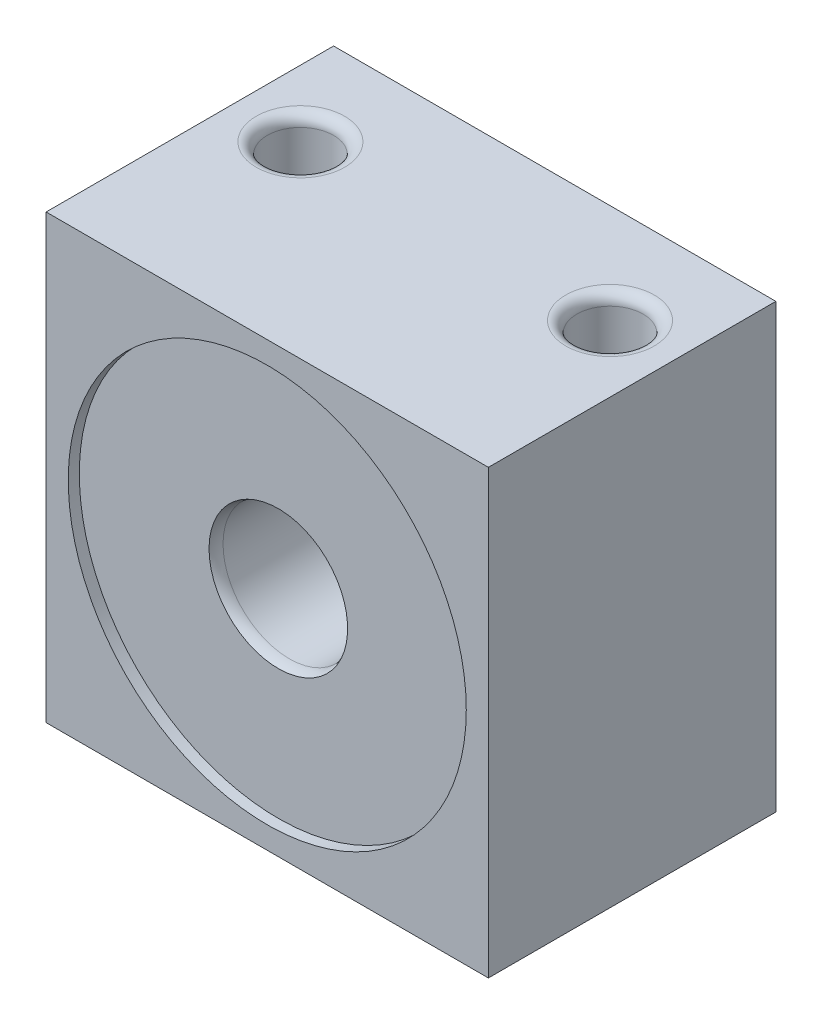
ISO-10303-21;
HEADER;
FILE_DESCRIPTION(('STEP AP214'),'2;1');
FILE_NAME('part.step','',(''),(''),'','','');
FILE_SCHEMA(('AUTOMOTIVE_DESIGN { 1 0 10303 214 1 1 1 1 }'));
ENDSEC;
DATA;
#1=APPLICATION_CONTEXT('core data for automotive mechanical design processes');
#2=APPLICATION_PROTOCOL_DEFINITION('international standard','automotive_design',2000,#1);
#3=PRODUCT_CONTEXT('',#1,'mechanical');
#4=PRODUCT('Part','Part','',(#3));
#5=PRODUCT_RELATED_PRODUCT_CATEGORY('part','',(#4));
#6=PRODUCT_DEFINITION_FORMATION('','',#4);
#7=PRODUCT_DEFINITION_CONTEXT('part definition',#1,'design');
#8=PRODUCT_DEFINITION('design','',#6,#7);
#9=PRODUCT_DEFINITION_SHAPE('','',#8);
#10=(LENGTH_UNIT() NAMED_UNIT(*) SI_UNIT(.MILLI.,.METRE.));
#11=(NAMED_UNIT(*) PLANE_ANGLE_UNIT() SI_UNIT($,.RADIAN.));
#12=(NAMED_UNIT(*) SI_UNIT($,.STERADIAN.) SOLID_ANGLE_UNIT());
#13=UNCERTAINTY_MEASURE_WITH_UNIT(LENGTH_MEASURE(1.E-05),#10,'distance_accuracy_value','');
#14=(GEOMETRIC_REPRESENTATION_CONTEXT(3) GLOBAL_UNCERTAINTY_ASSIGNED_CONTEXT((#13)) GLOBAL_UNIT_ASSIGNED_CONTEXT((#10,
#11,#12)) REPRESENTATION_CONTEXT('',''));
#15=CARTESIAN_POINT('',(0.,0.,0.));
#16=DIRECTION('',(0.,0.,1.));
#17=DIRECTION('',(1.,0.,0.));
#18=AXIS2_PLACEMENT_3D('',#15,#16,#17);
#19=CARTESIAN_POINT('',(-10.,20.,-6.5));
#20=DIRECTION('',(0.,0.,1.));
#21=DIRECTION('',(1.,0.,0.));
#22=AXIS2_PLACEMENT_3D('',#19,#20,#21);
#23=PLANE('',#22);
#24=DIRECTION('',(-1.,0.,0.));
#25=VECTOR('',#24,1.);
#26=CARTESIAN_POINT('',(-10.,0.,-6.5));
#27=LINE('',#26,#25);
#28=CARTESIAN_POINT('',(10.,0.,-6.5));
#29=VERTEX_POINT('',#28);
#30=CARTESIAN_POINT('',(-10.,0.,-6.5));
#31=VERTEX_POINT('',#30);
#32=EDGE_CURVE('E75',#29,#31,#27,.T.);
#33=ORIENTED_EDGE('',*,*,#32,.T.);
#34=DIRECTION('',(0.,-1.,0.));
#35=VECTOR('',#34,1.);
#36=CARTESIAN_POINT('',(-10.,20.,-6.5));
#37=LINE('',#36,#35);
#38=CARTESIAN_POINT('',(-10.,20.,-6.5));
#39=VERTEX_POINT('',#38);
#40=EDGE_CURVE('E99',#39,#31,#37,.T.);
#41=ORIENTED_EDGE('',*,*,#40,.F.);
#42=DIRECTION('',(-1.,0.,0.));
#43=VECTOR('',#42,1.);
#44=CARTESIAN_POINT('',(-10.,20.,-6.5));
#45=LINE('',#44,#43);
#46=CARTESIAN_POINT('',(10.,20.,-6.5));
#47=VERTEX_POINT('',#46);
#48=EDGE_CURVE('E52',#47,#39,#45,.T.);
#49=ORIENTED_EDGE('',*,*,#48,.F.);
#50=DIRECTION('',(0.,-1.,0.));
#51=VECTOR('',#50,1.);
#52=CARTESIAN_POINT('',(10.,20.,-6.5));
#53=LINE('',#52,#51);
#54=EDGE_CURVE('E95',#47,#29,#53,.T.);
#55=ORIENTED_EDGE('',*,*,#54,.T.);
#56=EDGE_LOOP('',(#33,#41,#49,#55));
#57=FACE_BOUND('',#56,.T.);
#58=CARTESIAN_POINT('',(0.,10.,-6.5));
#59=DIRECTION('',(0.,0.,1.));
#60=DIRECTION('',(1.,0.,0.));
#61=AXIS2_PLACEMENT_3D('',#58,#59,#60);
#62=CIRCLE('',#61,9.);
#63=CARTESIAN_POINT('',(9.,10.,-6.5));
#64=VERTEX_POINT('',#63);
#65=EDGE_CURVE('E150',#64,#64,#62,.T.);
#66=ORIENTED_EDGE('',*,*,#65,.T.);
#67=EDGE_LOOP('',(#66));
#68=FACE_BOUND('',#67,.T.);
#69=ADVANCED_FACE('F33',(#57,#68),#23,.F.);
#70=CARTESIAN_POINT('',(0.,10.,-5.5));
#71=DIRECTION('',(0.,0.,1.));
#72=DIRECTION('',(1.,0.,0.));
#73=AXIS2_PLACEMENT_3D('',#70,#71,#72);
#74=TOROIDAL_SURFACE('',#73,4.,1.);
#75=CARTESIAN_POINT('',(0.,10.,-5.5));
#76=DIRECTION('',(0.,0.,1.));
#77=DIRECTION('',(1.,0.,0.));
#78=AXIS2_PLACEMENT_3D('',#75,#76,#77);
#79=CIRCLE('',#78,3.);
#80=CARTESIAN_POINT('',(3.,10.,-5.5));
#81=VERTEX_POINT('',#80);
#82=EDGE_CURVE('E11',#81,#81,#79,.F.);
#83=ORIENTED_EDGE('',*,*,#82,.F.);
#84=EDGE_LOOP('',(#83));
#85=FACE_BOUND('',#84,.T.);
#86=CARTESIAN_POINT('',(0.,10.,-6.));
#87=DIRECTION('',(0.,0.,1.));
#88=DIRECTION('',(1.,0.,0.));
#89=AXIS2_PLACEMENT_3D('',#86,#87,#88);
#90=CIRCLE('',#89,3.13397459621556);
#91=CARTESIAN_POINT('',(3.13397459621556,10.,-6.));
#92=VERTEX_POINT('',#91);
#93=EDGE_CURVE('E37',#92,#92,#90,.F.);
#94=ORIENTED_EDGE('',*,*,#93,.T.);
#95=EDGE_LOOP('',(#94));
#96=FACE_BOUND('',#95,.T.);
#97=ADVANCED_FACE('F35',(#85,#96),#74,.T.);
#98=CARTESIAN_POINT('',(0.,10.,5.5));
#99=DIRECTION('',(0.,0.,-1.));
#100=DIRECTION('',(-1.,0.,0.));
#101=AXIS2_PLACEMENT_3D('',#98,#99,#100);
#102=TOROIDAL_SURFACE('',#101,4.,1.);
#103=CARTESIAN_POINT('',(0.,10.,5.5));
#104=DIRECTION('',(0.,0.,-1.));
#105=DIRECTION('',(-1.,0.,0.));
#106=AXIS2_PLACEMENT_3D('',#103,#104,#105);
#107=CIRCLE('',#106,3.);
#108=CARTESIAN_POINT('',(-3.,10.,5.5));
#109=VERTEX_POINT('',#108);
#110=EDGE_CURVE('E113',#109,#109,#107,.F.);
#111=ORIENTED_EDGE('',*,*,#110,.F.);
#112=EDGE_LOOP('',(#111));
#113=FACE_BOUND('',#112,.T.);
#114=CARTESIAN_POINT('',(0.,10.,6.));
#115=DIRECTION('',(0.,0.,-1.));
#116=DIRECTION('',(-1.,0.,0.));
#117=AXIS2_PLACEMENT_3D('',#114,#115,#116);
#118=CIRCLE('',#117,3.13397459621556);
#119=CARTESIAN_POINT('',(-3.13397459621557,10.,6.));
#120=VERTEX_POINT('',#119);
#121=EDGE_CURVE('E106',#120,#120,#118,.F.);
#122=ORIENTED_EDGE('',*,*,#121,.T.);
#123=EDGE_LOOP('',(#122));
#124=FACE_BOUND('',#123,.T.);
#125=ADVANCED_FACE('F180',(#113,#124),#102,.T.);
#126=CARTESIAN_POINT('',(-10.,20.,-6.5));
#127=DIRECTION('',(1.,0.,0.));
#128=DIRECTION('',(0.,0.,-1.));
#129=AXIS2_PLACEMENT_3D('',#126,#127,#128);
#130=PLANE('',#129);
#131=DIRECTION('',(0.,0.,1.));
#132=VECTOR('',#131,1.);
#133=CARTESIAN_POINT('',(-10.,0.,-6.5));
#134=LINE('',#133,#132);
#135=CARTESIAN_POINT('',(-10.,0.,6.5));
#136=VERTEX_POINT('',#135);
#137=EDGE_CURVE('E103',#31,#136,#134,.T.);
#138=ORIENTED_EDGE('',*,*,#137,.T.);
#139=DIRECTION('',(0.,-1.,0.));
#140=VECTOR('',#139,1.);
#141=CARTESIAN_POINT('',(-10.,20.,6.5));
#142=LINE('',#141,#140);
#143=CARTESIAN_POINT('',(-10.,20.,6.5));
#144=VERTEX_POINT('',#143);
#145=EDGE_CURVE('E94',#144,#136,#142,.T.);
#146=ORIENTED_EDGE('',*,*,#145,.F.);
#147=DIRECTION('',(0.,0.,1.));
#148=VECTOR('',#147,1.);
#149=CARTESIAN_POINT('',(-10.,20.,-6.5));
#150=LINE('',#149,#148);
#151=EDGE_CURVE('E88',#39,#144,#150,.T.);
#152=ORIENTED_EDGE('',*,*,#151,.F.);
#153=ORIENTED_EDGE('',*,*,#40,.T.);
#154=EDGE_LOOP('',(#138,#146,#152,#153));
#155=FACE_BOUND('',#154,.T.);
#156=ADVANCED_FACE('F191',(#155),#130,.F.);
#157=CARTESIAN_POINT('',(-10.,20.,6.5));
#158=DIRECTION('',(0.,0.,-1.));
#159=DIRECTION('',(-1.,0.,0.));
#160=AXIS2_PLACEMENT_3D('',#157,#158,#159);
#161=PLANE('',#160);
#162=CARTESIAN_POINT('',(0.,10.,6.5));
#163=DIRECTION('',(0.,0.,1.));
#164=DIRECTION('',(1.,0.,0.));
#165=AXIS2_PLACEMENT_3D('',#162,#163,#164);
#166=CIRCLE('',#165,9.);
#167=CARTESIAN_POINT('',(9.,10.,6.5));
#168=VERTEX_POINT('',#167);
#169=EDGE_CURVE('E143',#168,#168,#166,.T.);
#170=ORIENTED_EDGE('',*,*,#169,.F.);
#171=EDGE_LOOP('',(#170));
#172=FACE_BOUND('',#171,.T.);
#173=DIRECTION('',(1.,0.,0.));
#174=VECTOR('',#173,1.);
#175=CARTESIAN_POINT('',(-10.,0.,6.5));
#176=LINE('',#175,#174);
#177=CARTESIAN_POINT('',(10.,0.,6.5));
#178=VERTEX_POINT('',#177);
#179=EDGE_CURVE('E93',#136,#178,#176,.T.);
#180=ORIENTED_EDGE('',*,*,#179,.T.);
#181=DIRECTION('',(0.,-1.,0.));
#182=VECTOR('',#181,1.);
#183=CARTESIAN_POINT('',(10.,20.,6.5));
#184=LINE('',#183,#182);
#185=CARTESIAN_POINT('',(10.,20.,6.5));
#186=VERTEX_POINT('',#185);
#187=EDGE_CURVE('E91',#186,#178,#184,.T.);
#188=ORIENTED_EDGE('',*,*,#187,.F.);
#189=DIRECTION('',(1.,0.,0.));
#190=VECTOR('',#189,1.);
#191=CARTESIAN_POINT('',(-10.,20.,6.5));
#192=LINE('',#191,#190);
#193=EDGE_CURVE('E83',#144,#186,#192,.T.);
#194=ORIENTED_EDGE('',*,*,#193,.F.);
#195=ORIENTED_EDGE('',*,*,#145,.T.);
#196=EDGE_LOOP('',(#180,#188,#194,#195));
#197=FACE_BOUND('',#196,.T.);
#198=ADVANCED_FACE('F92',(#172,#197),#161,.F.);
#199=CARTESIAN_POINT('',(10.,20.,-6.5));
#200=DIRECTION('',(-1.,0.,0.));
#201=DIRECTION('',(0.,0.,1.));
#202=AXIS2_PLACEMENT_3D('',#199,#200,#201);
#203=PLANE('',#202);
#204=DIRECTION('',(0.,0.,-1.));
#205=VECTOR('',#204,1.);
#206=CARTESIAN_POINT('',(10.,0.,-6.5));
#207=LINE('',#206,#205);
#208=EDGE_CURVE('E69',#178,#29,#207,.T.);
#209=ORIENTED_EDGE('',*,*,#208,.T.);
#210=ORIENTED_EDGE('',*,*,#54,.F.);
#211=DIRECTION('',(0.,0.,-1.));
#212=VECTOR('',#211,1.);
#213=CARTESIAN_POINT('',(10.,20.,-6.5));
#214=LINE('',#213,#212);
#215=EDGE_CURVE('E86',#186,#47,#214,.T.);
#216=ORIENTED_EDGE('',*,*,#215,.F.);
#217=ORIENTED_EDGE('',*,*,#187,.T.);
#218=EDGE_LOOP('',(#209,#210,#216,#217));
#219=FACE_BOUND('',#218,.T.);
#220=ADVANCED_FACE('F97',(#219),#203,.F.);
#221=CARTESIAN_POINT('',(0.,20.,0.));
#222=DIRECTION('',(0.,1.,0.));
#223=DIRECTION('',(0.,0.,1.));
#224=AXIS2_PLACEMENT_3D('',#221,#222,#223);
#225=PLANE('',#224);
#226=CARTESIAN_POINT('',(7.,20.,-2.));
#227=DIRECTION('',(0.,1.,0.));
#228=DIRECTION('',(0.,0.,1.));
#229=AXIS2_PLACEMENT_3D('',#226,#227,#228);
#230=CIRCLE('',#229,2.);
#231=CARTESIAN_POINT('',(7.,20.,0.));
#232=VERTEX_POINT('',#231);
#233=EDGE_CURVE('E125',#232,#232,#230,.F.);
#234=ORIENTED_EDGE('',*,*,#233,.T.);
#235=EDGE_LOOP('',(#234));
#236=FACE_BOUND('',#235,.T.);
#237=CARTESIAN_POINT('',(-7.,20.,-2.));
#238=DIRECTION('',(0.,1.,0.));
#239=DIRECTION('',(0.,0.,1.));
#240=AXIS2_PLACEMENT_3D('',#237,#238,#239);
#241=CIRCLE('',#240,2.);
#242=CARTESIAN_POINT('',(-7.,20.,0.));
#243=VERTEX_POINT('',#242);
#244=EDGE_CURVE('E119',#243,#243,#241,.F.);
#245=ORIENTED_EDGE('',*,*,#244,.T.);
#246=EDGE_LOOP('',(#245));
#247=FACE_BOUND('',#246,.T.);
#248=ORIENTED_EDGE('',*,*,#151,.T.);
#249=ORIENTED_EDGE('',*,*,#193,.T.);
#250=ORIENTED_EDGE('',*,*,#215,.T.);
#251=ORIENTED_EDGE('',*,*,#48,.T.);
#252=EDGE_LOOP('',(#248,#249,#250,#251));
#253=FACE_BOUND('',#252,.T.);
#254=ADVANCED_FACE('F84',(#236,#247,#253),#225,.T.);
#255=CARTESIAN_POINT('',(0.,0.,0.));
#256=DIRECTION('',(0.,1.,0.));
#257=DIRECTION('',(0.,0.,1.));
#258=AXIS2_PLACEMENT_3D('',#255,#256,#257);
#259=PLANE('',#258);
#260=CARTESIAN_POINT('',(7.,0.,-2.));
#261=DIRECTION('',(0.,1.,0.));
#262=DIRECTION('',(0.,0.,1.));
#263=AXIS2_PLACEMENT_3D('',#260,#261,#262);
#264=CIRCLE('',#263,2.);
#265=CARTESIAN_POINT('',(7.,0.,0.));
#266=VERTEX_POINT('',#265);
#267=EDGE_CURVE('E134',#266,#266,#264,.T.);
#268=ORIENTED_EDGE('',*,*,#267,.T.);
#269=EDGE_LOOP('',(#268));
#270=FACE_BOUND('',#269,.T.);
#271=CARTESIAN_POINT('',(-7.,0.,-2.));
#272=DIRECTION('',(0.,1.,0.));
#273=DIRECTION('',(0.,0.,1.));
#274=AXIS2_PLACEMENT_3D('',#271,#272,#273);
#275=CIRCLE('',#274,2.);
#276=CARTESIAN_POINT('',(-7.,0.,0.));
#277=VERTEX_POINT('',#276);
#278=EDGE_CURVE('E128',#277,#277,#275,.T.);
#279=ORIENTED_EDGE('',*,*,#278,.T.);
#280=EDGE_LOOP('',(#279));
#281=FACE_BOUND('',#280,.T.);
#282=ORIENTED_EDGE('',*,*,#137,.F.);
#283=ORIENTED_EDGE('',*,*,#32,.F.);
#284=ORIENTED_EDGE('',*,*,#208,.F.);
#285=ORIENTED_EDGE('',*,*,#179,.F.);
#286=EDGE_LOOP('',(#282,#283,#284,#285));
#287=FACE_BOUND('',#286,.T.);
#288=ADVANCED_FACE('F185',(#270,#281,#287),#259,.F.);
#289=CARTESIAN_POINT('',(0.,10.,-13.5));
#290=DIRECTION('',(0.,0.,1.));
#291=DIRECTION('',(1.,0.,0.));
#292=AXIS2_PLACEMENT_3D('',#289,#290,#291);
#293=CYLINDRICAL_SURFACE('',#292,3.);
#294=ORIENTED_EDGE('',*,*,#82,.T.);
#295=EDGE_LOOP('',(#294));
#296=FACE_BOUND('',#295,.T.);
#297=ORIENTED_EDGE('',*,*,#110,.T.);
#298=EDGE_LOOP('',(#297));
#299=FACE_BOUND('',#298,.T.);
#300=ADVANCED_FACE('F225',(#296,#299),#293,.F.);
#301=CARTESIAN_POINT('',(-7.,0.,-2.));
#302=DIRECTION('',(0.,1.,0.));
#303=DIRECTION('',(0.,0.,1.));
#304=AXIS2_PLACEMENT_3D('',#301,#302,#303);
#305=CYLINDRICAL_SURFACE('',#304,1.5);
#306=CARTESIAN_POINT('',(-7.,0.5,-2.));
#307=DIRECTION('',(0.,1.,0.));
#308=DIRECTION('',(0.,0.,1.));
#309=AXIS2_PLACEMENT_3D('',#306,#307,#308);
#310=CIRCLE('',#309,1.5);
#311=CARTESIAN_POINT('',(-7.,0.5,-0.499999999999999));
#312=VERTEX_POINT('',#311);
#313=EDGE_CURVE('E131',#312,#312,#310,.F.);
#314=ORIENTED_EDGE('',*,*,#313,.T.);
#315=EDGE_LOOP('',(#314));
#316=FACE_BOUND('',#315,.T.);
#317=CARTESIAN_POINT('',(-7.,19.5,-2.));
#318=DIRECTION('',(0.,1.,0.));
#319=DIRECTION('',(0.,0.,1.));
#320=AXIS2_PLACEMENT_3D('',#317,#318,#319);
#321=CIRCLE('',#320,1.5);
#322=CARTESIAN_POINT('',(-7.,19.5,-0.499999999999999));
#323=VERTEX_POINT('',#322);
#324=EDGE_CURVE('E116',#323,#323,#321,.T.);
#325=ORIENTED_EDGE('',*,*,#324,.T.);
#326=EDGE_LOOP('',(#325));
#327=FACE_BOUND('',#326,.T.);
#328=ADVANCED_FACE('F234',(#316,#327),#305,.F.);
#329=CARTESIAN_POINT('',(7.,0.,-2.));
#330=DIRECTION('',(0.,1.,0.));
#331=DIRECTION('',(0.,0.,1.));
#332=AXIS2_PLACEMENT_3D('',#329,#330,#331);
#333=CYLINDRICAL_SURFACE('',#332,1.5);
#334=CARTESIAN_POINT('',(7.,0.5,-2.));
#335=DIRECTION('',(0.,1.,0.));
#336=DIRECTION('',(0.,0.,1.));
#337=AXIS2_PLACEMENT_3D('',#334,#335,#336);
#338=CIRCLE('',#337,1.5);
#339=CARTESIAN_POINT('',(7.,0.5,-0.500000000000002));
#340=VERTEX_POINT('',#339);
#341=EDGE_CURVE('E43',#340,#340,#338,.F.);
#342=ORIENTED_EDGE('',*,*,#341,.T.);
#343=EDGE_LOOP('',(#342));
#344=FACE_BOUND('',#343,.T.);
#345=CARTESIAN_POINT('',(7.,19.5,-2.));
#346=DIRECTION('',(0.,1.,0.));
#347=DIRECTION('',(0.,0.,1.));
#348=AXIS2_PLACEMENT_3D('',#345,#346,#347);
#349=CIRCLE('',#348,1.5);
#350=CARTESIAN_POINT('',(7.,19.5,-0.500000000000002));
#351=VERTEX_POINT('',#350);
#352=EDGE_CURVE('E122',#351,#351,#349,.T.);
#353=ORIENTED_EDGE('',*,*,#352,.T.);
#354=EDGE_LOOP('',(#353));
#355=FACE_BOUND('',#354,.T.);
#356=ADVANCED_FACE('F203',(#344,#355),#333,.F.);
#357=CARTESIAN_POINT('',(-7.,19.5,-2.));
#358=DIRECTION('',(0.,1.,0.));
#359=DIRECTION('',(0.,0.,1.));
#360=AXIS2_PLACEMENT_3D('',#357,#358,#359);
#361=TOROIDAL_SURFACE('',#360,2.,0.5);
#362=ORIENTED_EDGE('',*,*,#244,.F.);
#363=EDGE_LOOP('',(#362));
#364=FACE_BOUND('',#363,.T.);
#365=ORIENTED_EDGE('',*,*,#324,.F.);
#366=EDGE_LOOP('',(#365));
#367=FACE_BOUND('',#366,.T.);
#368=ADVANCED_FACE('F199',(#364,#367),#361,.T.);
#369=CARTESIAN_POINT('',(7.,19.5,-2.));
#370=DIRECTION('',(0.,1.,0.));
#371=DIRECTION('',(0.,0.,1.));
#372=AXIS2_PLACEMENT_3D('',#369,#370,#371);
#373=TOROIDAL_SURFACE('',#372,2.,0.5);
#374=ORIENTED_EDGE('',*,*,#233,.F.);
#375=EDGE_LOOP('',(#374));
#376=FACE_BOUND('',#375,.T.);
#377=ORIENTED_EDGE('',*,*,#352,.F.);
#378=EDGE_LOOP('',(#377));
#379=FACE_BOUND('',#378,.T.);
#380=ADVANCED_FACE('F202',(#376,#379),#373,.T.);
#381=CARTESIAN_POINT('',(-7.,0.5,-2.));
#382=DIRECTION('',(0.,1.,0.));
#383=DIRECTION('',(0.,0.,1.));
#384=AXIS2_PLACEMENT_3D('',#381,#382,#383);
#385=TOROIDAL_SURFACE('',#384,2.,0.5);
#386=ORIENTED_EDGE('',*,*,#313,.F.);
#387=EDGE_LOOP('',(#386));
#388=FACE_BOUND('',#387,.T.);
#389=ORIENTED_EDGE('',*,*,#278,.F.);
#390=EDGE_LOOP('',(#389));
#391=FACE_BOUND('',#390,.T.);
#392=ADVANCED_FACE('F207',(#388,#391),#385,.T.);
#393=CARTESIAN_POINT('',(7.,0.5,-2.));
#394=DIRECTION('',(0.,1.,0.));
#395=DIRECTION('',(0.,0.,1.));
#396=AXIS2_PLACEMENT_3D('',#393,#394,#395);
#397=TOROIDAL_SURFACE('',#396,2.,0.5);
#398=ORIENTED_EDGE('',*,*,#341,.F.);
#399=EDGE_LOOP('',(#398));
#400=FACE_BOUND('',#399,.T.);
#401=ORIENTED_EDGE('',*,*,#267,.F.);
#402=EDGE_LOOP('',(#401));
#403=FACE_BOUND('',#402,.T.);
#404=ADVANCED_FACE('F210',(#400,#403),#397,.T.);
#405=CARTESIAN_POINT('',(0.,10.,6.));
#406=DIRECTION('',(0.,0.,1.));
#407=DIRECTION('',(1.,0.,0.));
#408=AXIS2_PLACEMENT_3D('',#405,#406,#407);
#409=CYLINDRICAL_SURFACE('',#408,9.);
#410=CARTESIAN_POINT('',(0.,10.,6.));
#411=DIRECTION('',(0.,0.,1.));
#412=DIRECTION('',(1.,0.,0.));
#413=AXIS2_PLACEMENT_3D('',#410,#411,#412);
#414=CIRCLE('',#413,9.);
#415=CARTESIAN_POINT('',(9.,10.,6.));
#416=VERTEX_POINT('',#415);
#417=EDGE_CURVE('E139',#416,#416,#414,.T.);
#418=ORIENTED_EDGE('',*,*,#417,.F.);
#419=EDGE_LOOP('',(#418));
#420=FACE_BOUND('',#419,.T.);
#421=ORIENTED_EDGE('',*,*,#169,.T.);
#422=EDGE_LOOP('',(#421));
#423=FACE_BOUND('',#422,.T.);
#424=ADVANCED_FACE('F172',(#420,#423),#409,.F.);
#425=CARTESIAN_POINT('',(0.,10.,6.));
#426=DIRECTION('',(0.,0.,1.));
#427=DIRECTION('',(1.,0.,0.));
#428=AXIS2_PLACEMENT_3D('',#425,#426,#427);
#429=PLANE('',#428);
#430=ORIENTED_EDGE('',*,*,#121,.F.);
#431=EDGE_LOOP('',(#430));
#432=FACE_BOUND('',#431,.T.);
#433=ORIENTED_EDGE('',*,*,#417,.T.);
#434=EDGE_LOOP('',(#433));
#435=FACE_BOUND('',#434,.T.);
#436=ADVANCED_FACE('F165',(#432,#435),#429,.T.);
#437=CARTESIAN_POINT('',(0.,10.,-6.));
#438=DIRECTION('',(0.,0.,-1.));
#439=DIRECTION('',(1.,0.,0.));
#440=AXIS2_PLACEMENT_3D('',#437,#438,#439);
#441=PLANE('',#440);
#442=ORIENTED_EDGE('',*,*,#93,.F.);
#443=EDGE_LOOP('',(#442));
#444=FACE_BOUND('',#443,.T.);
#445=CARTESIAN_POINT('',(0.,10.,-6.));
#446=DIRECTION('',(0.,0.,1.));
#447=DIRECTION('',(1.,0.,0.));
#448=AXIS2_PLACEMENT_3D('',#445,#446,#447);
#449=CIRCLE('',#448,9.);
#450=CARTESIAN_POINT('',(9.,10.,-6.));
#451=VERTEX_POINT('',#450);
#452=EDGE_CURVE('E153',#451,#451,#449,.T.);
#453=ORIENTED_EDGE('',*,*,#452,.F.);
#454=EDGE_LOOP('',(#453));
#455=FACE_BOUND('',#454,.T.);
#456=ADVANCED_FACE('F161',(#444,#455),#441,.T.);
#457=CARTESIAN_POINT('',(0.,10.,-6.));
#458=DIRECTION('',(0.,0.,-1.));
#459=DIRECTION('',(-1.,0.,0.));
#460=AXIS2_PLACEMENT_3D('',#457,#458,#459);
#461=CYLINDRICAL_SURFACE('',#460,9.);
#462=ORIENTED_EDGE('',*,*,#452,.T.);
#463=EDGE_LOOP('',(#462));
#464=FACE_BOUND('',#463,.T.);
#465=ORIENTED_EDGE('',*,*,#65,.F.);
#466=EDGE_LOOP('',(#465));
#467=FACE_BOUND('',#466,.T.);
#468=ADVANCED_FACE('F164',(#464,#467),#461,.F.);
#469=CLOSED_SHELL('',(#69,#97,#125,#156,#198,#220,#254,#288,#300,#328,#356,#368,#380,#392,#404,
#424,#436,#456,#468));
#470=MANIFOLD_SOLID_BREP('B2',#469);
#471=ADVANCED_BREP_SHAPE_REPRESENTATION('',(#18,#470),#14);
#472=SHAPE_DEFINITION_REPRESENTATION(#9,#471);
ENDSEC;
END-ISO-10303-21;
